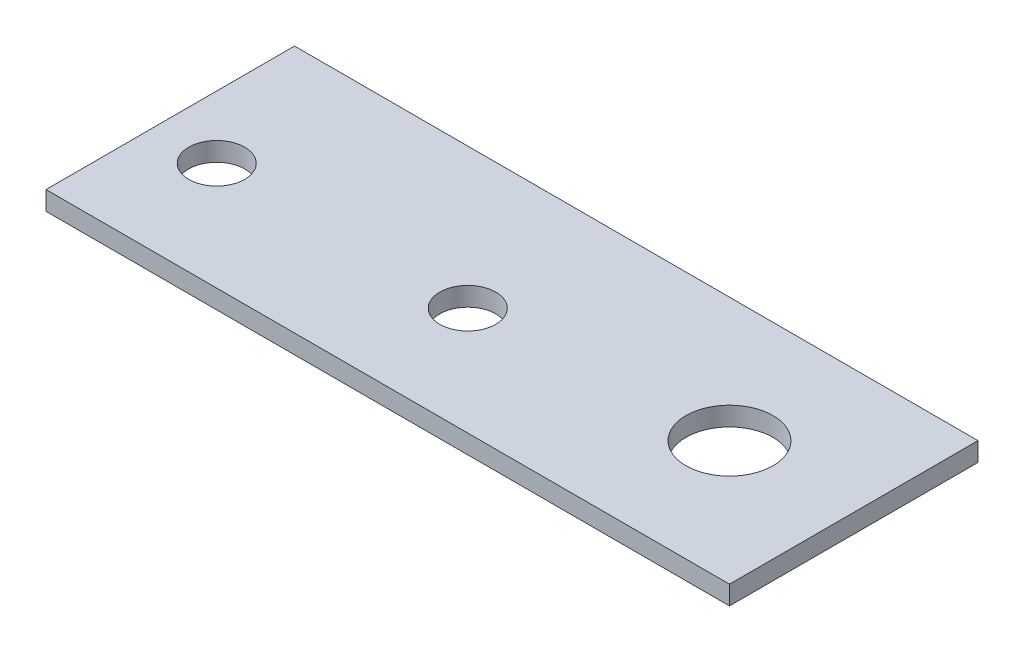
ISO-10303-21;
HEADER;
FILE_DESCRIPTION(('STEP AP214'),'2;1');
FILE_NAME('part.step','',(''),(''),'','','');
FILE_SCHEMA(('AUTOMOTIVE_DESIGN { 1 0 10303 214 1 1 1 1 }'));
ENDSEC;
DATA;
#1=APPLICATION_CONTEXT('core data for automotive mechanical design processes');
#2=APPLICATION_PROTOCOL_DEFINITION('international standard','automotive_design',2000,#1);
#3=PRODUCT_CONTEXT('',#1,'mechanical');
#4=PRODUCT('Part','Part','',(#3));
#5=PRODUCT_RELATED_PRODUCT_CATEGORY('part','',(#4));
#6=PRODUCT_DEFINITION_FORMATION('','',#4);
#7=PRODUCT_DEFINITION_CONTEXT('part definition',#1,'design');
#8=PRODUCT_DEFINITION('design','',#6,#7);
#9=PRODUCT_DEFINITION_SHAPE('','',#8);
#10=(LENGTH_UNIT() NAMED_UNIT(*) SI_UNIT(.MILLI.,.METRE.));
#11=(NAMED_UNIT(*) PLANE_ANGLE_UNIT() SI_UNIT($,.RADIAN.));
#12=(NAMED_UNIT(*) SI_UNIT($,.STERADIAN.) SOLID_ANGLE_UNIT());
#13=UNCERTAINTY_MEASURE_WITH_UNIT(LENGTH_MEASURE(1.E-05),#10,'distance_accuracy_value','');
#14=(GEOMETRIC_REPRESENTATION_CONTEXT(3) GLOBAL_UNCERTAINTY_ASSIGNED_CONTEXT((#13)) GLOBAL_UNIT_ASSIGNED_CONTEXT((#10,
#11,#12)) REPRESENTATION_CONTEXT('',''));
#15=CARTESIAN_POINT('',(0.,0.,0.));
#16=DIRECTION('',(0.,0.,1.));
#17=DIRECTION('',(1.,0.,0.));
#18=AXIS2_PLACEMENT_3D('',#15,#16,#17);
#19=CARTESIAN_POINT('',(13.75,0.38,5.));
#20=DIRECTION('',(0.,1.,0.));
#21=DIRECTION('',(0.,0.,1.));
#22=AXIS2_PLACEMENT_3D('',#19,#20,#21);
#23=PLANE('',#22);
#24=CARTESIAN_POINT('',(-1.13,0.38,0.65));
#25=DIRECTION('',(0.,1.,0.));
#26=DIRECTION('',(0.,0.,1.));
#27=AXIS2_PLACEMENT_3D('',#24,#25,#26);
#28=CIRCLE('',#27,1.125);
#29=CARTESIAN_POINT('',(-1.13,0.38,1.775));
#30=VERTEX_POINT('',#29);
#31=EDGE_CURVE('E115',#30,#30,#28,.T.);
#32=ORIENTED_EDGE('',*,*,#31,.F.);
#33=EDGE_LOOP('',(#32));
#34=FACE_BOUND('',#33,.T.);
#35=DIRECTION('',(0.,0.,-1.));
#36=VECTOR('',#35,1.);
#37=CARTESIAN_POINT('',(13.75,0.38,-5.));
#38=LINE('',#37,#36);
#39=CARTESIAN_POINT('',(13.75,0.38,5.));
#40=VERTEX_POINT('',#39);
#41=CARTESIAN_POINT('',(13.75,0.38,-5.));
#42=VERTEX_POINT('',#41);
#43=EDGE_CURVE('E85',#40,#42,#38,.T.);
#44=ORIENTED_EDGE('',*,*,#43,.T.);
#45=DIRECTION('',(-1.,0.,0.));
#46=VECTOR('',#45,1.);
#47=CARTESIAN_POINT('',(-13.75,0.38,-5.));
#48=LINE('',#47,#46);
#49=CARTESIAN_POINT('',(-13.75,0.38,-5.));
#50=VERTEX_POINT('',#49);
#51=EDGE_CURVE('E80',#42,#50,#48,.T.);
#52=ORIENTED_EDGE('',*,*,#51,.T.);
#53=DIRECTION('',(0.,0.,1.));
#54=VECTOR('',#53,1.);
#55=CARTESIAN_POINT('',(-13.75,0.38,-5.));
#56=LINE('',#55,#54);
#57=CARTESIAN_POINT('',(-13.75,0.38,5.));
#58=VERTEX_POINT('',#57);
#59=EDGE_CURVE('E83',#50,#58,#56,.T.);
#60=ORIENTED_EDGE('',*,*,#59,.T.);
#61=DIRECTION('',(1.,0.,0.));
#62=VECTOR('',#61,1.);
#63=CARTESIAN_POINT('',(-13.75,0.38,5.));
#64=LINE('',#63,#62);
#65=EDGE_CURVE('E50',#58,#40,#64,.T.);
#66=ORIENTED_EDGE('',*,*,#65,.T.);
#67=EDGE_LOOP('',(#44,#52,#60,#66));
#68=FACE_BOUND('',#67,.T.);
#69=CARTESIAN_POINT('',(8.75,0.38,0.));
#70=DIRECTION('',(0.,1.,0.));
#71=DIRECTION('',(0.,0.,1.));
#72=AXIS2_PLACEMENT_3D('',#69,#70,#71);
#73=CIRCLE('',#72,1.75);
#74=CARTESIAN_POINT('',(8.75,0.38,1.75));
#75=VERTEX_POINT('',#74);
#76=EDGE_CURVE('E100',#75,#75,#73,.T.);
#77=ORIENTED_EDGE('',*,*,#76,.F.);
#78=EDGE_LOOP('',(#77));
#79=FACE_BOUND('',#78,.T.);
#80=CARTESIAN_POINT('',(-11.23,0.38,0.65));
#81=DIRECTION('',(0.,1.,0.));
#82=DIRECTION('',(0.,0.,1.));
#83=AXIS2_PLACEMENT_3D('',#80,#81,#82);
#84=CIRCLE('',#83,1.125);
#85=CARTESIAN_POINT('',(-11.23,0.38,1.775));
#86=VERTEX_POINT('',#85);
#87=EDGE_CURVE('E121',#86,#86,#84,.T.);
#88=ORIENTED_EDGE('',*,*,#87,.F.);
#89=EDGE_LOOP('',(#88));
#90=FACE_BOUND('',#89,.T.);
#91=ADVANCED_FACE('F33',(#34,#68,#79,#90),#23,.T.);
#92=CARTESIAN_POINT('',(13.75,-0.38,5.));
#93=DIRECTION('',(0.,1.,0.));
#94=DIRECTION('',(0.,0.,1.));
#95=AXIS2_PLACEMENT_3D('',#92,#93,#94);
#96=PLANE('',#95);
#97=CARTESIAN_POINT('',(-1.13,-0.38,0.65));
#98=DIRECTION('',(0.,1.,0.));
#99=DIRECTION('',(0.,0.,1.));
#100=AXIS2_PLACEMENT_3D('',#97,#98,#99);
#101=CIRCLE('',#100,1.125);
#102=CARTESIAN_POINT('',(-1.13,-0.38,1.775));
#103=VERTEX_POINT('',#102);
#104=EDGE_CURVE('E118',#103,#103,#101,.T.);
#105=ORIENTED_EDGE('',*,*,#104,.T.);
#106=EDGE_LOOP('',(#105));
#107=FACE_BOUND('',#106,.T.);
#108=DIRECTION('',(0.,0.,-1.));
#109=VECTOR('',#108,1.);
#110=CARTESIAN_POINT('',(13.75,-0.38,-5.));
#111=LINE('',#110,#109);
#112=CARTESIAN_POINT('',(13.75,-0.38,5.));
#113=VERTEX_POINT('',#112);
#114=CARTESIAN_POINT('',(13.75,-0.38,-5.));
#115=VERTEX_POINT('',#114);
#116=EDGE_CURVE('E97',#113,#115,#111,.T.);
#117=ORIENTED_EDGE('',*,*,#116,.F.);
#118=DIRECTION('',(1.,0.,0.));
#119=VECTOR('',#118,1.);
#120=CARTESIAN_POINT('',(-13.75,-0.38,5.));
#121=LINE('',#120,#119);
#122=CARTESIAN_POINT('',(-13.75,-0.38,5.));
#123=VERTEX_POINT('',#122);
#124=EDGE_CURVE('E73',#123,#113,#121,.T.);
#125=ORIENTED_EDGE('',*,*,#124,.F.);
#126=DIRECTION('',(0.,0.,1.));
#127=VECTOR('',#126,1.);
#128=CARTESIAN_POINT('',(-13.75,-0.38,-5.));
#129=LINE('',#128,#127);
#130=CARTESIAN_POINT('',(-13.75,-0.38,-5.));
#131=VERTEX_POINT('',#130);
#132=EDGE_CURVE('E67',#131,#123,#129,.T.);
#133=ORIENTED_EDGE('',*,*,#132,.F.);
#134=DIRECTION('',(-1.,0.,0.));
#135=VECTOR('',#134,1.);
#136=CARTESIAN_POINT('',(-13.75,-0.38,-5.));
#137=LINE('',#136,#135);
#138=EDGE_CURVE('E89',#115,#131,#137,.T.);
#139=ORIENTED_EDGE('',*,*,#138,.F.);
#140=EDGE_LOOP('',(#117,#125,#133,#139));
#141=FACE_BOUND('',#140,.T.);
#142=CARTESIAN_POINT('',(8.75,-0.38,0.));
#143=DIRECTION('',(0.,1.,0.));
#144=DIRECTION('',(0.,0.,1.));
#145=AXIS2_PLACEMENT_3D('',#142,#143,#144);
#146=CIRCLE('',#145,1.75);
#147=CARTESIAN_POINT('',(8.75,-0.38,1.75));
#148=VERTEX_POINT('',#147);
#149=EDGE_CURVE('E112',#148,#148,#146,.T.);
#150=ORIENTED_EDGE('',*,*,#149,.T.);
#151=EDGE_LOOP('',(#150));
#152=FACE_BOUND('',#151,.T.);
#153=CARTESIAN_POINT('',(-11.23,-0.38,0.65));
#154=DIRECTION('',(0.,1.,0.));
#155=DIRECTION('',(0.,0.,1.));
#156=AXIS2_PLACEMENT_3D('',#153,#154,#155);
#157=CIRCLE('',#156,1.125);
#158=CARTESIAN_POINT('',(-11.23,-0.38,1.775));
#159=VERTEX_POINT('',#158);
#160=EDGE_CURVE('E124',#159,#159,#157,.T.);
#161=ORIENTED_EDGE('',*,*,#160,.T.);
#162=EDGE_LOOP('',(#161));
#163=FACE_BOUND('',#162,.T.);
#164=ADVANCED_FACE('F108',(#107,#141,#152,#163),#96,.F.);
#165=CARTESIAN_POINT('',(13.75,0.38,-5.));
#166=DIRECTION('',(-1.,0.,0.));
#167=DIRECTION('',(0.,0.,1.));
#168=AXIS2_PLACEMENT_3D('',#165,#166,#167);
#169=PLANE('',#168);
#170=ORIENTED_EDGE('',*,*,#116,.T.);
#171=DIRECTION('',(0.,-1.,0.));
#172=VECTOR('',#171,1.);
#173=CARTESIAN_POINT('',(13.75,0.38,-5.));
#174=LINE('',#173,#172);
#175=EDGE_CURVE('E11',#42,#115,#174,.T.);
#176=ORIENTED_EDGE('',*,*,#175,.F.);
#177=ORIENTED_EDGE('',*,*,#43,.F.);
#178=DIRECTION('',(0.,-1.,0.));
#179=VECTOR('',#178,1.);
#180=CARTESIAN_POINT('',(13.75,0.38,5.));
#181=LINE('',#180,#179);
#182=EDGE_CURVE('E93',#40,#113,#181,.T.);
#183=ORIENTED_EDGE('',*,*,#182,.T.);
#184=EDGE_LOOP('',(#170,#176,#177,#183));
#185=FACE_BOUND('',#184,.T.);
#186=ADVANCED_FACE('F35',(#185),#169,.F.);
#187=CARTESIAN_POINT('',(-13.75,0.38,-5.));
#188=DIRECTION('',(0.,0.,1.));
#189=DIRECTION('',(1.,0.,0.));
#190=AXIS2_PLACEMENT_3D('',#187,#188,#189);
#191=PLANE('',#190);
#192=ORIENTED_EDGE('',*,*,#138,.T.);
#193=DIRECTION('',(0.,-1.,0.));
#194=VECTOR('',#193,1.);
#195=CARTESIAN_POINT('',(-13.75,0.38,-5.));
#196=LINE('',#195,#194);
#197=EDGE_CURVE('E42',#50,#131,#196,.T.);
#198=ORIENTED_EDGE('',*,*,#197,.F.);
#199=ORIENTED_EDGE('',*,*,#51,.F.);
#200=ORIENTED_EDGE('',*,*,#175,.T.);
#201=EDGE_LOOP('',(#192,#198,#199,#200));
#202=FACE_BOUND('',#201,.T.);
#203=ADVANCED_FACE('F88',(#202),#191,.F.);
#204=CARTESIAN_POINT('',(-13.75,0.38,-5.));
#205=DIRECTION('',(1.,0.,0.));
#206=DIRECTION('',(0.,0.,-1.));
#207=AXIS2_PLACEMENT_3D('',#204,#205,#206);
#208=PLANE('',#207);
#209=ORIENTED_EDGE('',*,*,#132,.T.);
#210=DIRECTION('',(0.,-1.,0.));
#211=VECTOR('',#210,1.);
#212=CARTESIAN_POINT('',(-13.75,0.38,5.));
#213=LINE('',#212,#211);
#214=EDGE_CURVE('E90',#58,#123,#213,.T.);
#215=ORIENTED_EDGE('',*,*,#214,.F.);
#216=ORIENTED_EDGE('',*,*,#59,.F.);
#217=ORIENTED_EDGE('',*,*,#197,.T.);
#218=EDGE_LOOP('',(#209,#215,#216,#217));
#219=FACE_BOUND('',#218,.T.);
#220=ADVANCED_FACE('F91',(#219),#208,.F.);
#221=CARTESIAN_POINT('',(-13.75,0.38,5.));
#222=DIRECTION('',(0.,0.,-1.));
#223=DIRECTION('',(-1.,0.,0.));
#224=AXIS2_PLACEMENT_3D('',#221,#222,#223);
#225=PLANE('',#224);
#226=ORIENTED_EDGE('',*,*,#124,.T.);
#227=ORIENTED_EDGE('',*,*,#182,.F.);
#228=ORIENTED_EDGE('',*,*,#65,.F.);
#229=ORIENTED_EDGE('',*,*,#214,.T.);
#230=EDGE_LOOP('',(#226,#227,#228,#229));
#231=FACE_BOUND('',#230,.T.);
#232=ADVANCED_FACE('F105',(#231),#225,.F.);
#233=CARTESIAN_POINT('',(8.75,0.38,0.));
#234=DIRECTION('',(0.,-1.,0.));
#235=DIRECTION('',(0.,0.,-1.));
#236=AXIS2_PLACEMENT_3D('',#233,#234,#235);
#237=CYLINDRICAL_SURFACE('',#236,1.75);
#238=ORIENTED_EDGE('',*,*,#76,.T.);
#239=EDGE_LOOP('',(#238));
#240=FACE_BOUND('',#239,.T.);
#241=ORIENTED_EDGE('',*,*,#149,.F.);
#242=EDGE_LOOP('',(#241));
#243=FACE_BOUND('',#242,.T.);
#244=ADVANCED_FACE('F143',(#240,#243),#237,.F.);
#245=CARTESIAN_POINT('',(-1.13,0.38,0.65));
#246=DIRECTION('',(0.,-1.,0.));
#247=DIRECTION('',(0.,0.,-1.));
#248=AXIS2_PLACEMENT_3D('',#245,#246,#247);
#249=CYLINDRICAL_SURFACE('',#248,1.125);
#250=ORIENTED_EDGE('',*,*,#31,.T.);
#251=EDGE_LOOP('',(#250));
#252=FACE_BOUND('',#251,.T.);
#253=ORIENTED_EDGE('',*,*,#104,.F.);
#254=EDGE_LOOP('',(#253));
#255=FACE_BOUND('',#254,.T.);
#256=ADVANCED_FACE('F189',(#252,#255),#249,.F.);
#257=CARTESIAN_POINT('',(-11.23,0.38,0.65));
#258=DIRECTION('',(0.,-1.,0.));
#259=DIRECTION('',(0.,0.,-1.));
#260=AXIS2_PLACEMENT_3D('',#257,#258,#259);
#261=CYLINDRICAL_SURFACE('',#260,1.125);
#262=ORIENTED_EDGE('',*,*,#87,.T.);
#263=EDGE_LOOP('',(#262));
#264=FACE_BOUND('',#263,.T.);
#265=ORIENTED_EDGE('',*,*,#160,.F.);
#266=EDGE_LOOP('',(#265));
#267=FACE_BOUND('',#266,.T.);
#268=ADVANCED_FACE('F130',(#264,#267),#261,.F.);
#269=CLOSED_SHELL('',(#91,#164,#186,#203,#220,#232,#244,#256,#268));
#270=MANIFOLD_SOLID_BREP('B2',#269);
#271=ADVANCED_BREP_SHAPE_REPRESENTATION('',(#18,#270),#14);
#272=SHAPE_DEFINITION_REPRESENTATION(#9,#271);
ENDSEC;
END-ISO-10303-21;
